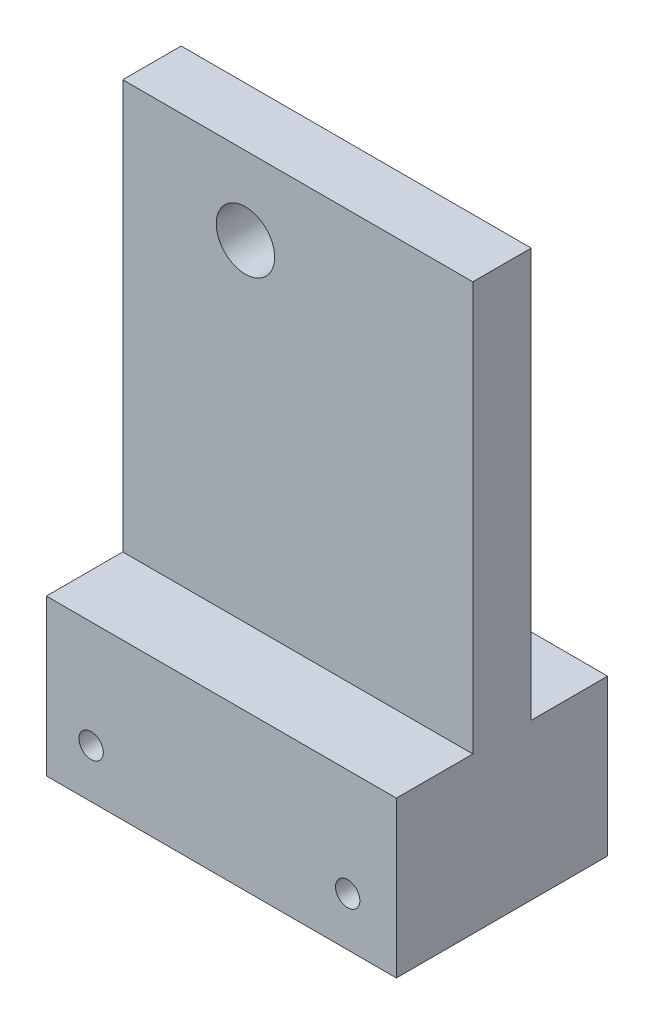
ISO-10303-21;
HEADER;
FILE_DESCRIPTION(('STEP AP214'),'2;1');
FILE_NAME('part.step','',(''),(''),'','','');
FILE_SCHEMA(('AUTOMOTIVE_DESIGN { 1 0 10303 214 1 1 1 1 }'));
ENDSEC;
DATA;
#1=APPLICATION_CONTEXT('core data for automotive mechanical design processes');
#2=APPLICATION_PROTOCOL_DEFINITION('international standard','automotive_design',2000,#1);
#3=PRODUCT_CONTEXT('',#1,'mechanical');
#4=PRODUCT('Part','Part','',(#3));
#5=PRODUCT_RELATED_PRODUCT_CATEGORY('part','',(#4));
#6=PRODUCT_DEFINITION_FORMATION('','',#4);
#7=PRODUCT_DEFINITION_CONTEXT('part definition',#1,'design');
#8=PRODUCT_DEFINITION('design','',#6,#7);
#9=PRODUCT_DEFINITION_SHAPE('','',#8);
#10=(LENGTH_UNIT() NAMED_UNIT(*) SI_UNIT(.MILLI.,.METRE.));
#11=(NAMED_UNIT(*) PLANE_ANGLE_UNIT() SI_UNIT($,.RADIAN.));
#12=(NAMED_UNIT(*) SI_UNIT($,.STERADIAN.) SOLID_ANGLE_UNIT());
#13=UNCERTAINTY_MEASURE_WITH_UNIT(LENGTH_MEASURE(1.E-05),#10,'distance_accuracy_value','');
#14=(GEOMETRIC_REPRESENTATION_CONTEXT(3) GLOBAL_UNCERTAINTY_ASSIGNED_CONTEXT((#13)) GLOBAL_UNIT_ASSIGNED_CONTEXT((#10,
#11,#12)) REPRESENTATION_CONTEXT('',''));
#15=CARTESIAN_POINT('',(0.,0.,0.));
#16=DIRECTION('',(0.,0.,1.));
#17=DIRECTION('',(1.,0.,0.));
#18=AXIS2_PLACEMENT_3D('',#15,#16,#17);
#19=CARTESIAN_POINT('',(-12.6000000000001,630.,10.85));
#20=DIRECTION('',(1.,0.,0.));
#21=DIRECTION('',(0.,0.,-1.));
#22=AXIS2_PLACEMENT_3D('',#19,#20,#21);
#23=PLANE('',#22);
#24=DIRECTION('',(0.,-1.,0.));
#25=VECTOR('',#24,1.);
#26=CARTESIAN_POINT('',(-12.6000000000001,630.,-3.00000000000001));
#27=LINE('',#26,#25);
#28=CARTESIAN_POINT('',(-12.6000000000001,678.,-3.00000000000001));
#29=VERTEX_POINT('',#28);
#30=CARTESIAN_POINT('',(-12.6000000000001,636.,-3.00000000000001));
#31=VERTEX_POINT('',#30);
#32=EDGE_CURVE('E117',#29,#31,#27,.T.);
#33=ORIENTED_EDGE('',*,*,#32,.T.);
#34=DIRECTION('',(0.,0.,-1.));
#35=VECTOR('',#34,1.);
#36=CARTESIAN_POINT('',(-12.6000000000001,636.,47.2972564125203));
#37=LINE('',#36,#35);
#38=CARTESIAN_POINT('',(-12.6000000000001,636.,-10.85));
#39=VERTEX_POINT('',#38);
#40=EDGE_CURVE('E115',#31,#39,#37,.T.);
#41=ORIENTED_EDGE('',*,*,#40,.T.);
#42=DIRECTION('',(0.,-1.,0.));
#43=VECTOR('',#42,1.);
#44=CARTESIAN_POINT('',(-12.6000000000001,630.,-10.85));
#45=LINE('',#44,#43);
#46=CARTESIAN_POINT('',(-12.6000000000001,620.,-10.85));
#47=VERTEX_POINT('',#46);
#48=EDGE_CURVE('E102',#39,#47,#45,.T.);
#49=ORIENTED_EDGE('',*,*,#48,.T.);
#50=DIRECTION('',(0.,0.,-1.));
#51=VECTOR('',#50,1.);
#52=CARTESIAN_POINT('',(-12.6000000000001,620.,10.85));
#53=LINE('',#52,#51);
#54=CARTESIAN_POINT('',(-12.6000000000001,620.,10.85));
#55=VERTEX_POINT('',#54);
#56=EDGE_CURVE('E47',#55,#47,#53,.T.);
#57=ORIENTED_EDGE('',*,*,#56,.F.);
#58=DIRECTION('',(0.,-1.,0.));
#59=VECTOR('',#58,1.);
#60=CARTESIAN_POINT('',(-12.6000000000001,630.,10.85));
#61=LINE('',#60,#59);
#62=CARTESIAN_POINT('',(-12.6000000000001,636.,10.85));
#63=VERTEX_POINT('',#62);
#64=EDGE_CURVE('E172',#63,#55,#61,.T.);
#65=ORIENTED_EDGE('',*,*,#64,.F.);
#66=CARTESIAN_POINT('',(-12.6000000000001,636.,3.00000000000001));
#67=VERTEX_POINT('',#66);
#68=EDGE_CURVE('E120',#63,#67,#37,.T.);
#69=ORIENTED_EDGE('',*,*,#68,.T.);
#70=DIRECTION('',(0.,-1.,0.));
#71=VECTOR('',#70,1.);
#72=CARTESIAN_POINT('',(-12.6000000000001,630.,3.00000000000001));
#73=LINE('',#72,#71);
#74=CARTESIAN_POINT('',(-12.6000000000001,678.,3.00000000000001));
#75=VERTEX_POINT('',#74);
#76=EDGE_CURVE('E59',#75,#67,#73,.T.);
#77=ORIENTED_EDGE('',*,*,#76,.F.);
#78=DIRECTION('',(0.,0.,-1.));
#79=VECTOR('',#78,1.);
#80=CARTESIAN_POINT('',(-12.6000000000001,678.,3.00000000000001));
#81=LINE('',#80,#79);
#82=EDGE_CURVE('E153',#75,#29,#81,.T.);
#83=ORIENTED_EDGE('',*,*,#82,.T.);
#84=EDGE_LOOP('',(#33,#41,#49,#57,#65,#69,#77,#83));
#85=FACE_BOUND('',#84,.T.);
#86=ADVANCED_FACE('F40',(#85),#23,.F.);
#87=CARTESIAN_POINT('',(-12.6000000000001,620.,10.85));
#88=DIRECTION('',(0.,1.,0.));
#89=DIRECTION('',(0.,0.,1.));
#90=AXIS2_PLACEMENT_3D('',#87,#88,#89);
#91=PLANE('',#90);
#92=ORIENTED_EDGE('',*,*,#56,.T.);
#93=DIRECTION('',(1.,0.,0.));
#94=VECTOR('',#93,1.);
#95=CARTESIAN_POINT('',(-12.6000000000001,620.,-10.85));
#96=LINE('',#95,#94);
#97=CARTESIAN_POINT('',(23.35,620.,-10.85));
#98=VERTEX_POINT('',#97);
#99=EDGE_CURVE('E109',#47,#98,#96,.T.);
#100=ORIENTED_EDGE('',*,*,#99,.T.);
#101=DIRECTION('',(0.,0.,-1.));
#102=VECTOR('',#101,1.);
#103=CARTESIAN_POINT('',(23.35,620.,10.85));
#104=LINE('',#103,#102);
#105=CARTESIAN_POINT('',(23.35,620.,10.85));
#106=VERTEX_POINT('',#105);
#107=EDGE_CURVE('E180',#106,#98,#104,.T.);
#108=ORIENTED_EDGE('',*,*,#107,.F.);
#109=DIRECTION('',(1.,0.,0.));
#110=VECTOR('',#109,1.);
#111=CARTESIAN_POINT('',(-12.6000000000001,620.,10.85));
#112=LINE('',#111,#110);
#113=EDGE_CURVE('E175',#55,#106,#112,.T.);
#114=ORIENTED_EDGE('',*,*,#113,.F.);
#115=EDGE_LOOP('',(#92,#100,#108,#114));
#116=FACE_BOUND('',#115,.T.);
#117=ADVANCED_FACE('F182',(#116),#91,.F.);
#118=CARTESIAN_POINT('',(23.35,630.,10.85));
#119=DIRECTION('',(1.,0.,0.));
#120=DIRECTION('',(0.,0.,-1.));
#121=AXIS2_PLACEMENT_3D('',#118,#119,#120);
#122=PLANE('',#121);
#123=DIRECTION('',(0.,1.,0.));
#124=VECTOR('',#123,1.);
#125=CARTESIAN_POINT('',(23.35,630.,3.00000000000001));
#126=LINE('',#125,#124);
#127=CARTESIAN_POINT('',(23.35,636.,3.00000000000001));
#128=VERTEX_POINT('',#127);
#129=CARTESIAN_POINT('',(23.35,678.,3.00000000000001));
#130=VERTEX_POINT('',#129);
#131=EDGE_CURVE('E149',#128,#130,#126,.T.);
#132=ORIENTED_EDGE('',*,*,#131,.F.);
#133=DIRECTION('',(0.,0.,-1.));
#134=VECTOR('',#133,1.);
#135=CARTESIAN_POINT('',(23.35,636.,47.2972564125203));
#136=LINE('',#135,#134);
#137=CARTESIAN_POINT('',(23.35,636.,10.85));
#138=VERTEX_POINT('',#137);
#139=EDGE_CURVE('E121',#138,#128,#136,.T.);
#140=ORIENTED_EDGE('',*,*,#139,.F.);
#141=DIRECTION('',(0.,-1.,0.));
#142=VECTOR('',#141,1.);
#143=CARTESIAN_POINT('',(23.35,630.,10.85));
#144=LINE('',#143,#142);
#145=EDGE_CURVE('E177',#138,#106,#144,.T.);
#146=ORIENTED_EDGE('',*,*,#145,.T.);
#147=ORIENTED_EDGE('',*,*,#107,.T.);
#148=DIRECTION('',(0.,-1.,0.));
#149=VECTOR('',#148,1.);
#150=CARTESIAN_POINT('',(23.35,630.,-10.85));
#151=LINE('',#150,#149);
#152=CARTESIAN_POINT('',(23.35,636.,-10.85));
#153=VERTEX_POINT('',#152);
#154=EDGE_CURVE('E170',#153,#98,#151,.T.);
#155=ORIENTED_EDGE('',*,*,#154,.F.);
#156=CARTESIAN_POINT('',(23.35,636.,-3.00000000000001));
#157=VERTEX_POINT('',#156);
#158=EDGE_CURVE('E126',#157,#153,#136,.T.);
#159=ORIENTED_EDGE('',*,*,#158,.F.);
#160=DIRECTION('',(0.,1.,0.));
#161=VECTOR('',#160,1.);
#162=CARTESIAN_POINT('',(23.35,630.,-3.00000000000001));
#163=LINE('',#162,#161);
#164=CARTESIAN_POINT('',(23.35,678.,-3.00000000000001));
#165=VERTEX_POINT('',#164);
#166=EDGE_CURVE('E140',#157,#165,#163,.T.);
#167=ORIENTED_EDGE('',*,*,#166,.T.);
#168=DIRECTION('',(0.,0.,-1.));
#169=VECTOR('',#168,1.);
#170=CARTESIAN_POINT('',(23.35,678.,3.00000000000001));
#171=LINE('',#170,#169);
#172=EDGE_CURVE('E155',#130,#165,#171,.T.);
#173=ORIENTED_EDGE('',*,*,#172,.F.);
#174=EDGE_LOOP('',(#132,#140,#146,#147,#155,#159,#167,#173));
#175=FACE_BOUND('',#174,.T.);
#176=ADVANCED_FACE('F192',(#175),#122,.T.);
#177=CARTESIAN_POINT('',(0.,0.,10.85));
#178=DIRECTION('',(0.,0.,1.));
#179=DIRECTION('',(1.,0.,0.));
#180=AXIS2_PLACEMENT_3D('',#177,#178,#179);
#181=PLANE('',#180);
#182=CARTESIAN_POINT('',(-8.,625.,10.85));
#183=DIRECTION('',(0.,0.,1.));
#184=DIRECTION('',(1.,0.,0.));
#185=AXIS2_PLACEMENT_3D('',#182,#183,#184);
#186=CIRCLE('',#185,1.24999999999993);
#187=CARTESIAN_POINT('',(-6.75000000000007,625.,10.85));
#188=VERTEX_POINT('',#187);
#189=EDGE_CURVE('E159',#188,#188,#186,.T.);
#190=ORIENTED_EDGE('',*,*,#189,.F.);
#191=EDGE_LOOP('',(#190));
#192=FACE_BOUND('',#191,.T.);
#193=CARTESIAN_POINT('',(18.35,625.,10.85));
#194=DIRECTION('',(0.,0.,1.));
#195=DIRECTION('',(1.,0.,0.));
#196=AXIS2_PLACEMENT_3D('',#193,#194,#195);
#197=CIRCLE('',#196,1.24999999999991);
#198=CARTESIAN_POINT('',(19.5999999999999,625.,10.85));
#199=VERTEX_POINT('',#198);
#200=EDGE_CURVE('E162',#199,#199,#197,.T.);
#201=ORIENTED_EDGE('',*,*,#200,.F.);
#202=EDGE_LOOP('',(#201));
#203=FACE_BOUND('',#202,.T.);
#204=ORIENTED_EDGE('',*,*,#64,.T.);
#205=ORIENTED_EDGE('',*,*,#113,.T.);
#206=ORIENTED_EDGE('',*,*,#145,.F.);
#207=DIRECTION('',(1.,0.,0.));
#208=VECTOR('',#207,1.);
#209=CARTESIAN_POINT('',(-12.6000000000001,636.,10.85));
#210=LINE('',#209,#208);
#211=EDGE_CURVE('E127',#63,#138,#210,.T.);
#212=ORIENTED_EDGE('',*,*,#211,.F.);
#213=EDGE_LOOP('',(#204,#205,#206,#212));
#214=FACE_BOUND('',#213,.T.);
#215=ADVANCED_FACE('F187',(#192,#203,#214),#181,.T.);
#216=CARTESIAN_POINT('',(0.,0.,-10.85));
#217=DIRECTION('',(0.,0.,1.));
#218=DIRECTION('',(1.,0.,0.));
#219=AXIS2_PLACEMENT_3D('',#216,#217,#218);
#220=PLANE('',#219);
#221=CARTESIAN_POINT('',(-8.,625.,-10.85));
#222=DIRECTION('',(0.,0.,1.));
#223=DIRECTION('',(1.,0.,0.));
#224=AXIS2_PLACEMENT_3D('',#221,#222,#223);
#225=CIRCLE('',#224,1.24999999999993);
#226=CARTESIAN_POINT('',(-6.75000000000007,625.,-10.85));
#227=VERTEX_POINT('',#226);
#228=EDGE_CURVE('E112',#227,#227,#225,.T.);
#229=ORIENTED_EDGE('',*,*,#228,.T.);
#230=EDGE_LOOP('',(#229));
#231=FACE_BOUND('',#230,.T.);
#232=CARTESIAN_POINT('',(18.35,625.,-10.85));
#233=DIRECTION('',(0.,0.,1.));
#234=DIRECTION('',(1.,0.,0.));
#235=AXIS2_PLACEMENT_3D('',#232,#233,#234);
#236=CIRCLE('',#235,1.24999999999991);
#237=CARTESIAN_POINT('',(19.5999999999999,625.,-10.85));
#238=VERTEX_POINT('',#237);
#239=EDGE_CURVE('E158',#238,#238,#236,.T.);
#240=ORIENTED_EDGE('',*,*,#239,.T.);
#241=EDGE_LOOP('',(#240));
#242=FACE_BOUND('',#241,.T.);
#243=ORIENTED_EDGE('',*,*,#48,.F.);
#244=DIRECTION('',(-1.,0.,0.));
#245=VECTOR('',#244,1.);
#246=CARTESIAN_POINT('',(-12.6000000000001,636.,-10.85));
#247=LINE('',#246,#245);
#248=EDGE_CURVE('E107',#153,#39,#247,.T.);
#249=ORIENTED_EDGE('',*,*,#248,.F.);
#250=ORIENTED_EDGE('',*,*,#154,.T.);
#251=ORIENTED_EDGE('',*,*,#99,.F.);
#252=EDGE_LOOP('',(#243,#249,#250,#251));
#253=FACE_BOUND('',#252,.T.);
#254=ADVANCED_FACE('F104',(#231,#242,#253),#220,.F.);
#255=CARTESIAN_POINT('',(18.35,625.,-10.85));
#256=DIRECTION('',(0.,0.,1.));
#257=DIRECTION('',(1.,0.,0.));
#258=AXIS2_PLACEMENT_3D('',#255,#256,#257);
#259=CYLINDRICAL_SURFACE('',#258,1.24999999999991);
#260=ORIENTED_EDGE('',*,*,#239,.F.);
#261=EDGE_LOOP('',(#260));
#262=FACE_BOUND('',#261,.T.);
#263=ORIENTED_EDGE('',*,*,#200,.T.);
#264=EDGE_LOOP('',(#263));
#265=FACE_BOUND('',#264,.T.);
#266=ADVANCED_FACE('F233',(#262,#265),#259,.F.);
#267=CARTESIAN_POINT('',(-8.,625.,-10.85));
#268=DIRECTION('',(0.,0.,1.));
#269=DIRECTION('',(1.,0.,0.));
#270=AXIS2_PLACEMENT_3D('',#267,#268,#269);
#271=CYLINDRICAL_SURFACE('',#270,1.24999999999993);
#272=ORIENTED_EDGE('',*,*,#228,.F.);
#273=EDGE_LOOP('',(#272));
#274=FACE_BOUND('',#273,.T.);
#275=ORIENTED_EDGE('',*,*,#189,.T.);
#276=EDGE_LOOP('',(#275));
#277=FACE_BOUND('',#276,.T.);
#278=ADVANCED_FACE('F236',(#274,#277),#271,.F.);
#279=CARTESIAN_POINT('',(0.,0.,3.00000000000001));
#280=DIRECTION('',(0.,0.,-1.));
#281=DIRECTION('',(-1.,0.,0.));
#282=AXIS2_PLACEMENT_3D('',#279,#280,#281);
#283=PLANE('',#282);
#284=ORIENTED_EDGE('',*,*,#76,.T.);
#285=DIRECTION('',(1.,0.,0.));
#286=VECTOR('',#285,1.);
#287=CARTESIAN_POINT('',(0.,636.,3.00000000000001));
#288=LINE('',#287,#286);
#289=EDGE_CURVE('E54',#67,#128,#288,.T.);
#290=ORIENTED_EDGE('',*,*,#289,.T.);
#291=ORIENTED_EDGE('',*,*,#131,.T.);
#292=DIRECTION('',(-1.,0.,0.));
#293=VECTOR('',#292,1.);
#294=CARTESIAN_POINT('',(-12.6000000000001,678.,3.00000000000001));
#295=LINE('',#294,#293);
#296=EDGE_CURVE('E151',#130,#75,#295,.T.);
#297=ORIENTED_EDGE('',*,*,#296,.T.);
#298=EDGE_LOOP('',(#284,#290,#291,#297));
#299=FACE_BOUND('',#298,.T.);
#300=CARTESIAN_POINT('',(0.,670.,3.00000000000001));
#301=DIRECTION('',(0.,0.,1.));
#302=DIRECTION('',(1.,0.,0.));
#303=AXIS2_PLACEMENT_3D('',#300,#301,#302);
#304=CIRCLE('',#303,3.);
#305=CARTESIAN_POINT('',(3.,670.,3.00000000000001));
#306=VERTEX_POINT('',#305);
#307=EDGE_CURVE('E145',#306,#306,#304,.T.);
#308=ORIENTED_EDGE('',*,*,#307,.F.);
#309=EDGE_LOOP('',(#308));
#310=FACE_BOUND('',#309,.T.);
#311=ADVANCED_FACE('F195',(#299,#310),#283,.F.);
#312=CARTESIAN_POINT('',(-12.6000000000001,678.,3.00000000000001));
#313=DIRECTION('',(0.,-1.,0.));
#314=DIRECTION('',(0.,0.,-1.));
#315=AXIS2_PLACEMENT_3D('',#312,#313,#314);
#316=PLANE('',#315);
#317=ORIENTED_EDGE('',*,*,#172,.T.);
#318=DIRECTION('',(-1.,0.,0.));
#319=VECTOR('',#318,1.);
#320=CARTESIAN_POINT('',(-12.6000000000001,678.,-3.00000000000001));
#321=LINE('',#320,#319);
#322=EDGE_CURVE('E142',#165,#29,#321,.T.);
#323=ORIENTED_EDGE('',*,*,#322,.T.);
#324=ORIENTED_EDGE('',*,*,#82,.F.);
#325=ORIENTED_EDGE('',*,*,#296,.F.);
#326=EDGE_LOOP('',(#317,#323,#324,#325));
#327=FACE_BOUND('',#326,.T.);
#328=ADVANCED_FACE('F199',(#327),#316,.F.);
#329=CARTESIAN_POINT('',(0.,670.,3.00000000000001));
#330=DIRECTION('',(0.,0.,-1.));
#331=DIRECTION('',(-1.,0.,0.));
#332=AXIS2_PLACEMENT_3D('',#329,#330,#331);
#333=CYLINDRICAL_SURFACE('',#332,3.);
#334=ORIENTED_EDGE('',*,*,#307,.T.);
#335=EDGE_LOOP('',(#334));
#336=FACE_BOUND('',#335,.T.);
#337=CARTESIAN_POINT('',(0.,670.,-3.00000000000001));
#338=DIRECTION('',(0.,0.,1.));
#339=DIRECTION('',(1.,0.,0.));
#340=AXIS2_PLACEMENT_3D('',#337,#338,#339);
#341=CIRCLE('',#340,3.);
#342=CARTESIAN_POINT('',(3.,670.,-3.00000000000001));
#343=VERTEX_POINT('',#342);
#344=EDGE_CURVE('E136',#343,#343,#341,.T.);
#345=ORIENTED_EDGE('',*,*,#344,.F.);
#346=EDGE_LOOP('',(#345));
#347=FACE_BOUND('',#346,.T.);
#348=ADVANCED_FACE('F206',(#336,#347),#333,.F.);
#349=CARTESIAN_POINT('',(0.,0.,-3.00000000000001));
#350=DIRECTION('',(0.,0.,-1.));
#351=DIRECTION('',(-1.,0.,0.));
#352=AXIS2_PLACEMENT_3D('',#349,#350,#351);
#353=PLANE('',#352);
#354=DIRECTION('',(1.,0.,0.));
#355=VECTOR('',#354,1.);
#356=CARTESIAN_POINT('',(0.,636.,-3.00000000000001));
#357=LINE('',#356,#355);
#358=EDGE_CURVE('E11',#31,#157,#357,.T.);
#359=ORIENTED_EDGE('',*,*,#358,.F.);
#360=ORIENTED_EDGE('',*,*,#32,.F.);
#361=ORIENTED_EDGE('',*,*,#322,.F.);
#362=ORIENTED_EDGE('',*,*,#166,.F.);
#363=EDGE_LOOP('',(#359,#360,#361,#362));
#364=FACE_BOUND('',#363,.T.);
#365=ORIENTED_EDGE('',*,*,#344,.T.);
#366=EDGE_LOOP('',(#365));
#367=FACE_BOUND('',#366,.T.);
#368=ADVANCED_FACE('F202',(#364,#367),#353,.T.);
#369=CARTESIAN_POINT('',(-12.6000000000001,636.,47.2972564125203));
#370=DIRECTION('',(0.,1.,0.));
#371=DIRECTION('',(0.,0.,1.));
#372=AXIS2_PLACEMENT_3D('',#369,#370,#371);
#373=PLANE('',#372);
#374=ORIENTED_EDGE('',*,*,#40,.F.);
#375=ORIENTED_EDGE('',*,*,#358,.T.);
#376=ORIENTED_EDGE('',*,*,#158,.T.);
#377=ORIENTED_EDGE('',*,*,#248,.T.);
#378=EDGE_LOOP('',(#374,#375,#376,#377));
#379=FACE_BOUND('',#378,.T.);
#380=ADVANCED_FACE('F124',(#379),#373,.T.);
#381=ORIENTED_EDGE('',*,*,#289,.F.);
#382=ORIENTED_EDGE('',*,*,#68,.F.);
#383=ORIENTED_EDGE('',*,*,#211,.T.);
#384=ORIENTED_EDGE('',*,*,#139,.T.);
#385=EDGE_LOOP('',(#381,#382,#383,#384));
#386=FACE_BOUND('',#385,.T.);
#387=ADVANCED_FACE('F190',(#386),#373,.T.);
#388=CLOSED_SHELL('',(#86,#117,#176,#215,#254,#266,#278,#311,#328,#348,#368,#380,#387));
#389=MANIFOLD_SOLID_BREP('B2',#388);
#390=ADVANCED_BREP_SHAPE_REPRESENTATION('',(#18,#389),#14);
#391=SHAPE_DEFINITION_REPRESENTATION(#9,#390);
ENDSEC;
END-ISO-10303-21;
